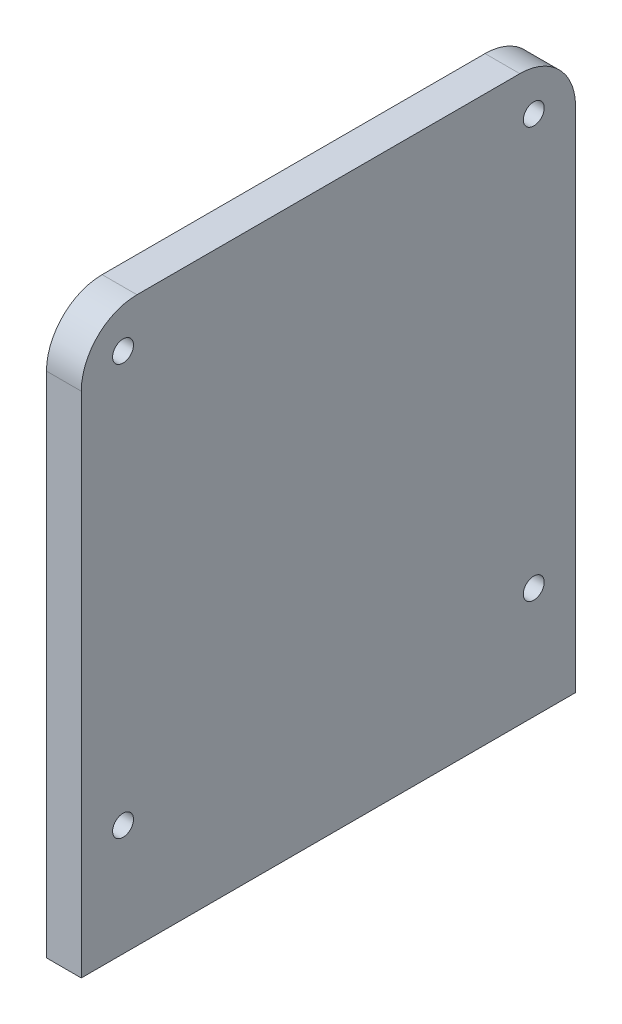
ISO-10303-21;
HEADER;
FILE_DESCRIPTION(('STEP AP214'),'2;1');
FILE_NAME('part.step','',(''),(''),'','','');
FILE_SCHEMA(('AUTOMOTIVE_DESIGN { 1 0 10303 214 1 1 1 1 }'));
ENDSEC;
DATA;
#1=APPLICATION_CONTEXT('core data for automotive mechanical design processes');
#2=APPLICATION_PROTOCOL_DEFINITION('international standard','automotive_design',2000,#1);
#3=PRODUCT_CONTEXT('',#1,'mechanical');
#4=PRODUCT('Part','Part','',(#3));
#5=PRODUCT_RELATED_PRODUCT_CATEGORY('part','',(#4));
#6=PRODUCT_DEFINITION_FORMATION('','',#4);
#7=PRODUCT_DEFINITION_CONTEXT('part definition',#1,'design');
#8=PRODUCT_DEFINITION('design','',#6,#7);
#9=PRODUCT_DEFINITION_SHAPE('','',#8);
#10=(LENGTH_UNIT() NAMED_UNIT(*) SI_UNIT(.MILLI.,.METRE.));
#11=(NAMED_UNIT(*) PLANE_ANGLE_UNIT() SI_UNIT($,.RADIAN.));
#12=(NAMED_UNIT(*) SI_UNIT($,.STERADIAN.) SOLID_ANGLE_UNIT());
#13=UNCERTAINTY_MEASURE_WITH_UNIT(LENGTH_MEASURE(1.E-05),#10,'distance_accuracy_value','');
#14=(GEOMETRIC_REPRESENTATION_CONTEXT(3) GLOBAL_UNCERTAINTY_ASSIGNED_CONTEXT((#13)) GLOBAL_UNIT_ASSIGNED_CONTEXT((#10,
#11,#12)) REPRESENTATION_CONTEXT('',''));
#15=CARTESIAN_POINT('',(0.,0.,0.));
#16=DIRECTION('',(0.,0.,1.));
#17=DIRECTION('',(1.,0.,0.));
#18=AXIS2_PLACEMENT_3D('',#15,#16,#17);
#19=CARTESIAN_POINT('',(5.,0.,0.));
#20=DIRECTION('',(-1.,0.,0.));
#21=DIRECTION('',(0.,0.,1.));
#22=AXIS2_PLACEMENT_3D('',#19,#20,#21);
#23=PLANE('',#22);
#24=CARTESIAN_POINT('',(5.,16.,-6.));
#25=DIRECTION('',(1.,0.,0.));
#26=DIRECTION('',(0.,0.,-1.));
#27=AXIS2_PLACEMENT_3D('',#24,#25,#26);
#28=CIRCLE('',#27,1.5);
#29=CARTESIAN_POINT('',(5.,16.,-7.5));
#30=VERTEX_POINT('',#29);
#31=EDGE_CURVE('E155',#30,#30,#28,.T.);
#32=ORIENTED_EDGE('',*,*,#31,.F.);
#33=EDGE_LOOP('',(#32));
#34=FACE_BOUND('',#33,.T.);
#35=CARTESIAN_POINT('',(5.,75.,-6.));
#36=DIRECTION('',(1.,0.,0.));
#37=DIRECTION('',(0.,0.,-1.));
#38=AXIS2_PLACEMENT_3D('',#35,#36,#37);
#39=CIRCLE('',#38,1.5);
#40=CARTESIAN_POINT('',(5.,75.,-7.5));
#41=VERTEX_POINT('',#40);
#42=EDGE_CURVE('E143',#41,#41,#39,.T.);
#43=ORIENTED_EDGE('',*,*,#42,.F.);
#44=EDGE_LOOP('',(#43));
#45=FACE_BOUND('',#44,.T.);
#46=DIRECTION('',(0.,1.,0.));
#47=VECTOR('',#46,1.);
#48=CARTESIAN_POINT('',(5.,0.,-71.));
#49=LINE('',#48,#47);
#50=CARTESIAN_POINT('',(5.,0.,-71.));
#51=VERTEX_POINT('',#50);
#52=CARTESIAN_POINT('',(5.,73.,-71.));
#53=VERTEX_POINT('',#52);
#54=EDGE_CURVE('E101',#51,#53,#49,.T.);
#55=ORIENTED_EDGE('',*,*,#54,.T.);
#56=CARTESIAN_POINT('',(5.,73.,-63.));
#57=DIRECTION('',(-1.,0.,0.));
#58=DIRECTION('',(0.,0.,1.));
#59=AXIS2_PLACEMENT_3D('',#56,#57,#58);
#60=CIRCLE('',#59,8.);
#61=CARTESIAN_POINT('',(5.,81.,-63.));
#62=VERTEX_POINT('',#61);
#63=EDGE_CURVE('E40',#53,#62,#60,.F.);
#64=ORIENTED_EDGE('',*,*,#63,.T.);
#65=DIRECTION('',(0.,0.,1.));
#66=VECTOR('',#65,1.);
#67=CARTESIAN_POINT('',(5.,81.,0.));
#68=LINE('',#67,#66);
#69=CARTESIAN_POINT('',(5.,81.,-8.));
#70=VERTEX_POINT('',#69);
#71=EDGE_CURVE('E111',#62,#70,#68,.T.);
#72=ORIENTED_EDGE('',*,*,#71,.T.);
#73=CARTESIAN_POINT('',(5.,73.,-8.));
#74=DIRECTION('',(-1.,0.,0.));
#75=DIRECTION('',(0.,0.,1.));
#76=AXIS2_PLACEMENT_3D('',#73,#74,#75);
#77=CIRCLE('',#76,8.);
#78=CARTESIAN_POINT('',(5.,73.,0.));
#79=VERTEX_POINT('',#78);
#80=EDGE_CURVE('E47',#70,#79,#77,.F.);
#81=ORIENTED_EDGE('',*,*,#80,.T.);
#82=DIRECTION('',(0.,-1.,0.));
#83=VECTOR('',#82,1.);
#84=CARTESIAN_POINT('',(5.,0.,0.));
#85=LINE('',#84,#83);
#86=CARTESIAN_POINT('',(5.,0.,0.));
#87=VERTEX_POINT('',#86);
#88=EDGE_CURVE('E85',#79,#87,#85,.T.);
#89=ORIENTED_EDGE('',*,*,#88,.T.);
#90=DIRECTION('',(0.,0.,-1.));
#91=VECTOR('',#90,1.);
#92=CARTESIAN_POINT('',(5.,0.,0.));
#93=LINE('',#92,#91);
#94=EDGE_CURVE('E88',#87,#51,#93,.T.);
#95=ORIENTED_EDGE('',*,*,#94,.T.);
#96=EDGE_LOOP('',(#55,#64,#72,#81,#89,#95));
#97=FACE_BOUND('',#96,.T.);
#98=CARTESIAN_POINT('',(5.,75.,-65.));
#99=DIRECTION('',(1.,0.,0.));
#100=DIRECTION('',(0.,0.,-1.));
#101=AXIS2_PLACEMENT_3D('',#98,#99,#100);
#102=CIRCLE('',#101,1.5);
#103=CARTESIAN_POINT('',(5.,75.,-66.5));
#104=VERTEX_POINT('',#103);
#105=EDGE_CURVE('E149',#104,#104,#102,.T.);
#106=ORIENTED_EDGE('',*,*,#105,.F.);
#107=EDGE_LOOP('',(#106));
#108=FACE_BOUND('',#107,.T.);
#109=CARTESIAN_POINT('',(5.,16.,-65.));
#110=DIRECTION('',(1.,0.,0.));
#111=DIRECTION('',(0.,0.,-1.));
#112=AXIS2_PLACEMENT_3D('',#109,#110,#111);
#113=CIRCLE('',#112,1.5);
#114=CARTESIAN_POINT('',(5.,16.,-66.5));
#115=VERTEX_POINT('',#114);
#116=EDGE_CURVE('E161',#115,#115,#113,.T.);
#117=ORIENTED_EDGE('',*,*,#116,.F.);
#118=EDGE_LOOP('',(#117));
#119=FACE_BOUND('',#118,.T.);
#120=ADVANCED_FACE('F32',(#34,#45,#97,#108,#119),#23,.F.);
#121=CARTESIAN_POINT('',(0.,0.,0.));
#122=DIRECTION('',(-1.,0.,0.));
#123=DIRECTION('',(0.,0.,1.));
#124=AXIS2_PLACEMENT_3D('',#121,#122,#123);
#125=PLANE('',#124);
#126=CARTESIAN_POINT('',(0.,16.,-6.));
#127=DIRECTION('',(1.,0.,0.));
#128=DIRECTION('',(0.,0.,-1.));
#129=AXIS2_PLACEMENT_3D('',#126,#127,#128);
#130=CIRCLE('',#129,1.5);
#131=CARTESIAN_POINT('',(0.,16.,-7.5));
#132=VERTEX_POINT('',#131);
#133=EDGE_CURVE('E158',#132,#132,#130,.T.);
#134=ORIENTED_EDGE('',*,*,#133,.T.);
#135=EDGE_LOOP('',(#134));
#136=FACE_BOUND('',#135,.T.);
#137=CARTESIAN_POINT('',(0.,75.,-6.));
#138=DIRECTION('',(1.,0.,0.));
#139=DIRECTION('',(0.,0.,-1.));
#140=AXIS2_PLACEMENT_3D('',#137,#138,#139);
#141=CIRCLE('',#140,1.5);
#142=CARTESIAN_POINT('',(0.,75.,-7.5));
#143=VERTEX_POINT('',#142);
#144=EDGE_CURVE('E146',#143,#143,#141,.T.);
#145=ORIENTED_EDGE('',*,*,#144,.T.);
#146=EDGE_LOOP('',(#145));
#147=FACE_BOUND('',#146,.T.);
#148=DIRECTION('',(0.,0.,1.));
#149=VECTOR('',#148,1.);
#150=CARTESIAN_POINT('',(0.,81.,0.));
#151=LINE('',#150,#149);
#152=CARTESIAN_POINT('',(0.,81.,-63.));
#153=VERTEX_POINT('',#152);
#154=CARTESIAN_POINT('',(0.,81.,-8.));
#155=VERTEX_POINT('',#154);
#156=EDGE_CURVE('E93',#153,#155,#151,.T.);
#157=ORIENTED_EDGE('',*,*,#156,.F.);
#158=CARTESIAN_POINT('',(0.,73.,-63.));
#159=DIRECTION('',(-1.,0.,0.));
#160=DIRECTION('',(0.,0.,1.));
#161=AXIS2_PLACEMENT_3D('',#158,#159,#160);
#162=CIRCLE('',#161,8.);
#163=CARTESIAN_POINT('',(0.,73.,-71.));
#164=VERTEX_POINT('',#163);
#165=EDGE_CURVE('E119',#153,#164,#162,.T.);
#166=ORIENTED_EDGE('',*,*,#165,.T.);
#167=DIRECTION('',(0.,1.,0.));
#168=VECTOR('',#167,1.);
#169=CARTESIAN_POINT('',(0.,0.,-71.));
#170=LINE('',#169,#168);
#171=CARTESIAN_POINT('',(0.,0.,-71.));
#172=VERTEX_POINT('',#171);
#173=EDGE_CURVE('E137',#172,#164,#170,.T.);
#174=ORIENTED_EDGE('',*,*,#173,.F.);
#175=DIRECTION('',(0.,0.,-1.));
#176=VECTOR('',#175,1.);
#177=CARTESIAN_POINT('',(0.,0.,0.));
#178=LINE('',#177,#176);
#179=CARTESIAN_POINT('',(0.,0.,0.));
#180=VERTEX_POINT('',#179);
#181=EDGE_CURVE('E139',#180,#172,#178,.T.);
#182=ORIENTED_EDGE('',*,*,#181,.F.);
#183=DIRECTION('',(0.,-1.,0.));
#184=VECTOR('',#183,1.);
#185=CARTESIAN_POINT('',(0.,0.,0.));
#186=LINE('',#185,#184);
#187=CARTESIAN_POINT('',(0.,73.,0.));
#188=VERTEX_POINT('',#187);
#189=EDGE_CURVE('E105',#188,#180,#186,.T.);
#190=ORIENTED_EDGE('',*,*,#189,.F.);
#191=CARTESIAN_POINT('',(0.,73.,-8.));
#192=DIRECTION('',(-1.,0.,0.));
#193=DIRECTION('',(0.,0.,1.));
#194=AXIS2_PLACEMENT_3D('',#191,#192,#193);
#195=CIRCLE('',#194,8.);
#196=EDGE_CURVE('E117',#188,#155,#195,.T.);
#197=ORIENTED_EDGE('',*,*,#196,.T.);
#198=EDGE_LOOP('',(#157,#166,#174,#182,#190,#197));
#199=FACE_BOUND('',#198,.T.);
#200=CARTESIAN_POINT('',(0.,75.,-65.));
#201=DIRECTION('',(1.,0.,0.));
#202=DIRECTION('',(0.,0.,-1.));
#203=AXIS2_PLACEMENT_3D('',#200,#201,#202);
#204=CIRCLE('',#203,1.5);
#205=CARTESIAN_POINT('',(0.,75.,-66.5));
#206=VERTEX_POINT('',#205);
#207=EDGE_CURVE('E152',#206,#206,#204,.T.);
#208=ORIENTED_EDGE('',*,*,#207,.T.);
#209=EDGE_LOOP('',(#208));
#210=FACE_BOUND('',#209,.T.);
#211=CARTESIAN_POINT('',(0.,16.,-65.));
#212=DIRECTION('',(1.,0.,0.));
#213=DIRECTION('',(0.,0.,-1.));
#214=AXIS2_PLACEMENT_3D('',#211,#212,#213);
#215=CIRCLE('',#214,1.5);
#216=CARTESIAN_POINT('',(0.,16.,-66.5));
#217=VERTEX_POINT('',#216);
#218=EDGE_CURVE('E164',#217,#217,#215,.T.);
#219=ORIENTED_EDGE('',*,*,#218,.T.);
#220=EDGE_LOOP('',(#219));
#221=FACE_BOUND('',#220,.T.);
#222=ADVANCED_FACE('F135',(#136,#147,#199,#210,#221),#125,.T.);
#223=CARTESIAN_POINT('',(5.,0.,0.));
#224=DIRECTION('',(0.,0.,-1.));
#225=DIRECTION('',(-1.,0.,0.));
#226=AXIS2_PLACEMENT_3D('',#223,#224,#225);
#227=PLANE('',#226);
#228=ORIENTED_EDGE('',*,*,#88,.F.);
#229=DIRECTION('',(-1.,0.,0.));
#230=VECTOR('',#229,1.);
#231=CARTESIAN_POINT('',(5.,73.,0.));
#232=LINE('',#231,#230);
#233=EDGE_CURVE('E11',#79,#188,#232,.T.);
#234=ORIENTED_EDGE('',*,*,#233,.T.);
#235=ORIENTED_EDGE('',*,*,#189,.T.);
#236=DIRECTION('',(-1.,0.,0.));
#237=VECTOR('',#236,1.);
#238=CARTESIAN_POINT('',(5.,0.,0.));
#239=LINE('',#238,#237);
#240=EDGE_CURVE('E98',#87,#180,#239,.T.);
#241=ORIENTED_EDGE('',*,*,#240,.F.);
#242=EDGE_LOOP('',(#228,#234,#235,#241));
#243=FACE_BOUND('',#242,.T.);
#244=ADVANCED_FACE('F103',(#243),#227,.F.);
#245=CARTESIAN_POINT('',(5.,0.,0.));
#246=DIRECTION('',(0.,1.,0.));
#247=DIRECTION('',(0.,0.,1.));
#248=AXIS2_PLACEMENT_3D('',#245,#246,#247);
#249=PLANE('',#248);
#250=ORIENTED_EDGE('',*,*,#181,.T.);
#251=DIRECTION('',(-1.,0.,0.));
#252=VECTOR('',#251,1.);
#253=CARTESIAN_POINT('',(5.,0.,-71.));
#254=LINE('',#253,#252);
#255=EDGE_CURVE('E100',#51,#172,#254,.T.);
#256=ORIENTED_EDGE('',*,*,#255,.F.);
#257=ORIENTED_EDGE('',*,*,#94,.F.);
#258=ORIENTED_EDGE('',*,*,#240,.T.);
#259=EDGE_LOOP('',(#250,#256,#257,#258));
#260=FACE_BOUND('',#259,.T.);
#261=ADVANCED_FACE('F97',(#260),#249,.F.);
#262=CARTESIAN_POINT('',(5.,0.,-71.));
#263=DIRECTION('',(0.,0.,1.));
#264=DIRECTION('',(1.,0.,0.));
#265=AXIS2_PLACEMENT_3D('',#262,#263,#264);
#266=PLANE('',#265);
#267=ORIENTED_EDGE('',*,*,#173,.T.);
#268=DIRECTION('',(-1.,0.,0.));
#269=VECTOR('',#268,1.);
#270=CARTESIAN_POINT('',(5.,73.,-71.));
#271=LINE('',#270,#269);
#272=EDGE_CURVE('E55',#164,#53,#271,.F.);
#273=ORIENTED_EDGE('',*,*,#272,.T.);
#274=ORIENTED_EDGE('',*,*,#54,.F.);
#275=ORIENTED_EDGE('',*,*,#255,.T.);
#276=EDGE_LOOP('',(#267,#273,#274,#275));
#277=FACE_BOUND('',#276,.T.);
#278=ADVANCED_FACE('F138',(#277),#266,.F.);
#279=CARTESIAN_POINT('',(5.,81.,0.));
#280=DIRECTION('',(0.,-1.,0.));
#281=DIRECTION('',(0.,0.,-1.));
#282=AXIS2_PLACEMENT_3D('',#279,#280,#281);
#283=PLANE('',#282);
#284=ORIENTED_EDGE('',*,*,#71,.F.);
#285=DIRECTION('',(-1.,0.,0.));
#286=VECTOR('',#285,1.);
#287=CARTESIAN_POINT('',(5.,81.,-63.));
#288=LINE('',#287,#286);
#289=EDGE_CURVE('E109',#62,#153,#288,.T.);
#290=ORIENTED_EDGE('',*,*,#289,.T.);
#291=ORIENTED_EDGE('',*,*,#156,.T.);
#292=DIRECTION('',(-1.,0.,0.));
#293=VECTOR('',#292,1.);
#294=CARTESIAN_POINT('',(5.,81.,-8.));
#295=LINE('',#294,#293);
#296=EDGE_CURVE('E107',#155,#70,#295,.F.);
#297=ORIENTED_EDGE('',*,*,#296,.T.);
#298=EDGE_LOOP('',(#284,#290,#291,#297));
#299=FACE_BOUND('',#298,.T.);
#300=ADVANCED_FACE('F127',(#299),#283,.F.);
#301=CARTESIAN_POINT('',(5.,75.,-6.));
#302=DIRECTION('',(-1.,0.,0.));
#303=DIRECTION('',(0.,0.,1.));
#304=AXIS2_PLACEMENT_3D('',#301,#302,#303);
#305=CYLINDRICAL_SURFACE('',#304,1.5);
#306=ORIENTED_EDGE('',*,*,#42,.T.);
#307=EDGE_LOOP('',(#306));
#308=FACE_BOUND('',#307,.T.);
#309=ORIENTED_EDGE('',*,*,#144,.F.);
#310=EDGE_LOOP('',(#309));
#311=FACE_BOUND('',#310,.T.);
#312=ADVANCED_FACE('F184',(#308,#311),#305,.F.);
#313=CARTESIAN_POINT('',(5.,75.,-65.));
#314=DIRECTION('',(-1.,0.,0.));
#315=DIRECTION('',(0.,0.,1.));
#316=AXIS2_PLACEMENT_3D('',#313,#314,#315);
#317=CYLINDRICAL_SURFACE('',#316,1.5);
#318=ORIENTED_EDGE('',*,*,#105,.T.);
#319=EDGE_LOOP('',(#318));
#320=FACE_BOUND('',#319,.T.);
#321=ORIENTED_EDGE('',*,*,#207,.F.);
#322=EDGE_LOOP('',(#321));
#323=FACE_BOUND('',#322,.T.);
#324=ADVANCED_FACE('F205',(#320,#323),#317,.F.);
#325=CARTESIAN_POINT('',(5.,16.,-6.));
#326=DIRECTION('',(-1.,0.,0.));
#327=DIRECTION('',(0.,0.,1.));
#328=AXIS2_PLACEMENT_3D('',#325,#326,#327);
#329=CYLINDRICAL_SURFACE('',#328,1.5);
#330=ORIENTED_EDGE('',*,*,#31,.T.);
#331=EDGE_LOOP('',(#330));
#332=FACE_BOUND('',#331,.T.);
#333=ORIENTED_EDGE('',*,*,#133,.F.);
#334=EDGE_LOOP('',(#333));
#335=FACE_BOUND('',#334,.T.);
#336=ADVANCED_FACE('F200',(#332,#335),#329,.F.);
#337=CARTESIAN_POINT('',(5.,16.,-65.));
#338=DIRECTION('',(-1.,0.,0.));
#339=DIRECTION('',(0.,0.,1.));
#340=AXIS2_PLACEMENT_3D('',#337,#338,#339);
#341=CYLINDRICAL_SURFACE('',#340,1.5);
#342=ORIENTED_EDGE('',*,*,#116,.T.);
#343=EDGE_LOOP('',(#342));
#344=FACE_BOUND('',#343,.T.);
#345=ORIENTED_EDGE('',*,*,#218,.F.);
#346=EDGE_LOOP('',(#345));
#347=FACE_BOUND('',#346,.T.);
#348=ADVANCED_FACE('F170',(#344,#347),#341,.F.);
#349=CARTESIAN_POINT('',(5.,73.,-63.));
#350=DIRECTION('',(-1.,0.,0.));
#351=DIRECTION('',(0.,0.,1.));
#352=AXIS2_PLACEMENT_3D('',#349,#350,#351);
#353=CYLINDRICAL_SURFACE('',#352,8.);
#354=ORIENTED_EDGE('',*,*,#63,.F.);
#355=ORIENTED_EDGE('',*,*,#272,.F.);
#356=ORIENTED_EDGE('',*,*,#165,.F.);
#357=ORIENTED_EDGE('',*,*,#289,.F.);
#358=EDGE_LOOP('',(#354,#355,#356,#357));
#359=FACE_BOUND('',#358,.T.);
#360=ADVANCED_FACE('F132',(#359),#353,.T.);
#361=CARTESIAN_POINT('',(5.,73.,-8.));
#362=DIRECTION('',(-1.,0.,0.));
#363=DIRECTION('',(0.,0.,1.));
#364=AXIS2_PLACEMENT_3D('',#361,#362,#363);
#365=CYLINDRICAL_SURFACE('',#364,8.);
#366=ORIENTED_EDGE('',*,*,#80,.F.);
#367=ORIENTED_EDGE('',*,*,#296,.F.);
#368=ORIENTED_EDGE('',*,*,#196,.F.);
#369=ORIENTED_EDGE('',*,*,#233,.F.);
#370=EDGE_LOOP('',(#366,#367,#368,#369));
#371=FACE_BOUND('',#370,.T.);
#372=ADVANCED_FACE('F34',(#371),#365,.T.);
#373=CLOSED_SHELL('',(#120,#222,#244,#261,#278,#300,#312,#324,#336,#348,#360,#372));
#374=MANIFOLD_SOLID_BREP('B2',#373);
#375=ADVANCED_BREP_SHAPE_REPRESENTATION('',(#18,#374),#14);
#376=SHAPE_DEFINITION_REPRESENTATION(#9,#375);
ENDSEC;
END-ISO-10303-21;
